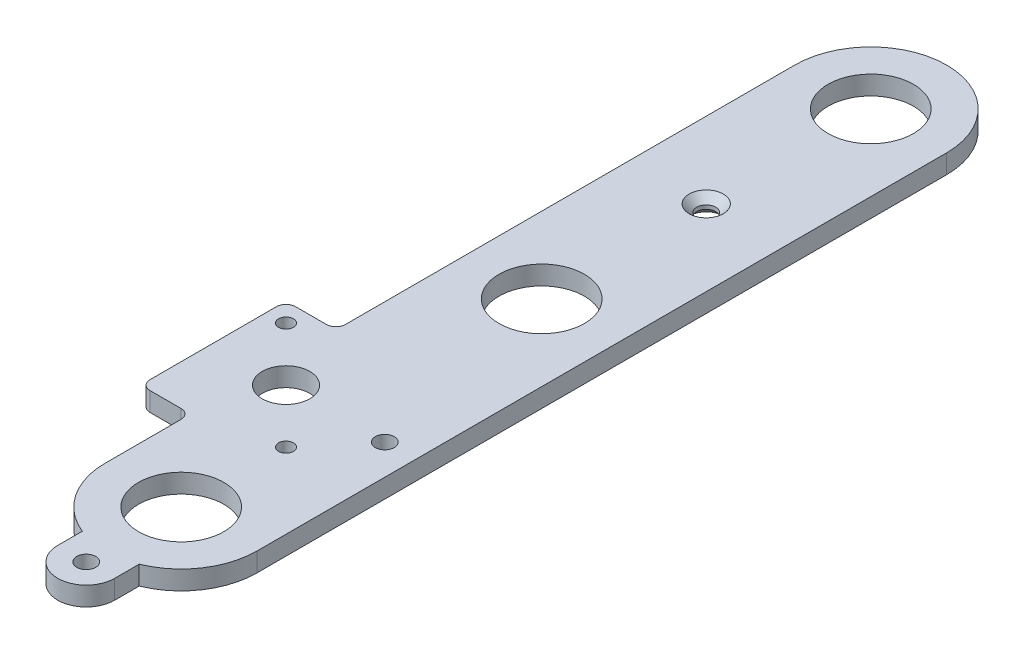
ISO-10303-21;
HEADER;
FILE_DESCRIPTION(('STEP AP214'),'2;1');
FILE_NAME('part.step','',(''),(''),'','','');
FILE_SCHEMA(('AUTOMOTIVE_DESIGN { 1 0 10303 214 1 1 1 1 }'));
ENDSEC;
DATA;
#1=APPLICATION_CONTEXT('core data for automotive mechanical design processes');
#2=APPLICATION_PROTOCOL_DEFINITION('international standard','automotive_design',2000,#1);
#3=PRODUCT_CONTEXT('',#1,'mechanical');
#4=PRODUCT('Part','Part','',(#3));
#5=PRODUCT_RELATED_PRODUCT_CATEGORY('part','',(#4));
#6=PRODUCT_DEFINITION_FORMATION('','',#4);
#7=PRODUCT_DEFINITION_CONTEXT('part definition',#1,'design');
#8=PRODUCT_DEFINITION('design','',#6,#7);
#9=PRODUCT_DEFINITION_SHAPE('','',#8);
#10=(LENGTH_UNIT() NAMED_UNIT(*) SI_UNIT(.MILLI.,.METRE.));
#11=(NAMED_UNIT(*) PLANE_ANGLE_UNIT() SI_UNIT($,.RADIAN.));
#12=(NAMED_UNIT(*) SI_UNIT($,.STERADIAN.) SOLID_ANGLE_UNIT());
#13=UNCERTAINTY_MEASURE_WITH_UNIT(LENGTH_MEASURE(1.E-05),#10,'distance_accuracy_value','');
#14=(GEOMETRIC_REPRESENTATION_CONTEXT(3) GLOBAL_UNCERTAINTY_ASSIGNED_CONTEXT((#13)) GLOBAL_UNIT_ASSIGNED_CONTEXT((#10,
#11,#12)) REPRESENTATION_CONTEXT('',''));
#15=CARTESIAN_POINT('',(0.,0.,0.));
#16=DIRECTION('',(0.,0.,1.));
#17=DIRECTION('',(1.,0.,0.));
#18=AXIS2_PLACEMENT_3D('',#15,#16,#17);
#19=CARTESIAN_POINT('',(-201.295000000001,6.35,-6.81052118455054E-13));
#20=DIRECTION('',(1.,0.,0.));
#21=DIRECTION('',(0.,0.,-1.));
#22=AXIS2_PLACEMENT_3D('',#19,#20,#21);
#23=PLANE('',#22);
#24=DIRECTION('',(0.,0.,1.));
#25=VECTOR('',#24,1.);
#26=CARTESIAN_POINT('',(-201.295000000001,0.,-6.81052118455054E-13));
#27=LINE('',#26,#25);
#28=CARTESIAN_POINT('',(-201.295,0.,-293.953569803471));
#29=VERTEX_POINT('',#28);
#30=CARTESIAN_POINT('',(-201.295,0.,-285.75));
#31=VERTEX_POINT('',#30);
#32=EDGE_CURVE('E258',#29,#31,#27,.T.);
#33=ORIENTED_EDGE('',*,*,#32,.F.);
#34=DIRECTION('',(0.,-1.,0.));
#35=VECTOR('',#34,1.);
#36=CARTESIAN_POINT('',(-201.295,6.35,-293.953569803471));
#37=LINE('',#36,#35);
#38=CARTESIAN_POINT('',(-201.295,6.35,-293.953569803471));
#39=VERTEX_POINT('',#38);
#40=EDGE_CURVE('E114',#39,#29,#37,.T.);
#41=ORIENTED_EDGE('',*,*,#40,.F.);
#42=DIRECTION('',(0.,0.,1.));
#43=VECTOR('',#42,1.);
#44=CARTESIAN_POINT('',(-201.295000000001,6.35,-6.81052118455054E-13));
#45=LINE('',#44,#43);
#46=CARTESIAN_POINT('',(-201.295,6.35,-285.75));
#47=VERTEX_POINT('',#46);
#48=EDGE_CURVE('E342',#39,#47,#45,.T.);
#49=ORIENTED_EDGE('',*,*,#48,.T.);
#50=DIRECTION('',(0.,-1.,0.));
#51=VECTOR('',#50,1.);
#52=CARTESIAN_POINT('',(-201.295,6.35,-285.75));
#53=LINE('',#52,#51);
#54=EDGE_CURVE('E110',#47,#31,#53,.T.);
#55=ORIENTED_EDGE('',*,*,#54,.T.);
#56=EDGE_LOOP('',(#33,#41,#49,#55));
#57=FACE_BOUND('',#56,.T.);
#58=ADVANCED_FACE('F34',(#57),#23,.T.);
#59=CARTESIAN_POINT('',(-210.82,6.35,-317.5));
#60=DIRECTION('',(0.,-1.,0.));
#61=DIRECTION('',(0.,0.,-1.));
#62=AXIS2_PLACEMENT_3D('',#59,#60,#61);
#63=CYLINDRICAL_SURFACE('',#62,25.4);
#64=CARTESIAN_POINT('',(-210.82,0.,-317.5));
#65=DIRECTION('',(0.,1.,0.));
#66=DIRECTION('',(0.,0.,1.));
#67=AXIS2_PLACEMENT_3D('',#64,#65,#66);
#68=CIRCLE('',#67,25.4);
#69=CARTESIAN_POINT('',(-185.42,0.,-317.5));
#70=VERTEX_POINT('',#69);
#71=EDGE_CURVE('E261',#29,#70,#68,.T.);
#72=ORIENTED_EDGE('',*,*,#71,.T.);
#73=DIRECTION('',(0.,-1.,0.));
#74=VECTOR('',#73,1.);
#75=CARTESIAN_POINT('',(-185.42,6.35,-317.5));
#76=LINE('',#75,#74);
#77=CARTESIAN_POINT('',(-185.42,6.35,-317.5));
#78=VERTEX_POINT('',#77);
#79=EDGE_CURVE('E203',#78,#70,#76,.T.);
#80=ORIENTED_EDGE('',*,*,#79,.F.);
#81=CARTESIAN_POINT('',(-210.82,6.35,-317.5));
#82=DIRECTION('',(0.,1.,0.));
#83=DIRECTION('',(0.,0.,1.));
#84=AXIS2_PLACEMENT_3D('',#81,#82,#83);
#85=CIRCLE('',#84,25.4);
#86=EDGE_CURVE('E340',#39,#78,#85,.T.);
#87=ORIENTED_EDGE('',*,*,#86,.F.);
#88=ORIENTED_EDGE('',*,*,#40,.T.);
#89=EDGE_LOOP('',(#72,#80,#87,#88));
#90=FACE_BOUND('',#89,.T.);
#91=ADVANCED_FACE('F405',(#90),#63,.T.);
#92=CARTESIAN_POINT('',(-185.42,6.35,0.));
#93=DIRECTION('',(1.,0.,0.));
#94=DIRECTION('',(0.,0.,-1.));
#95=AXIS2_PLACEMENT_3D('',#92,#93,#94);
#96=PLANE('',#95);
#97=DIRECTION('',(0.,0.,1.));
#98=VECTOR('',#97,1.);
#99=CARTESIAN_POINT('',(-185.42,0.,0.));
#100=LINE('',#99,#98);
#101=CARTESIAN_POINT('',(-185.42,0.,-548.034576396425));
#102=VERTEX_POINT('',#101);
#103=EDGE_CURVE('E263',#102,#70,#100,.T.);
#104=ORIENTED_EDGE('',*,*,#103,.F.);
#105=DIRECTION('',(0.,-1.,0.));
#106=VECTOR('',#105,1.);
#107=CARTESIAN_POINT('',(-185.42,6.35,-548.034576396425));
#108=LINE('',#107,#106);
#109=CARTESIAN_POINT('',(-185.42,6.35,-548.034576396425));
#110=VERTEX_POINT('',#109);
#111=EDGE_CURVE('E201',#110,#102,#108,.T.);
#112=ORIENTED_EDGE('',*,*,#111,.F.);
#113=DIRECTION('',(0.,0.,1.));
#114=VECTOR('',#113,1.);
#115=CARTESIAN_POINT('',(-185.42,6.35,0.));
#116=LINE('',#115,#114);
#117=EDGE_CURVE('E337',#110,#78,#116,.T.);
#118=ORIENTED_EDGE('',*,*,#117,.T.);
#119=ORIENTED_EDGE('',*,*,#79,.T.);
#120=EDGE_LOOP('',(#104,#112,#118,#119));
#121=FACE_BOUND('',#120,.T.);
#122=ADVANCED_FACE('F409',(#121),#96,.T.);
#123=CARTESIAN_POINT('',(-210.82,6.35,-548.034576396425));
#124=DIRECTION('',(0.,-1.,0.));
#125=DIRECTION('',(0.,0.,-1.));
#126=AXIS2_PLACEMENT_3D('',#123,#124,#125);
#127=CYLINDRICAL_SURFACE('',#126,25.4);
#128=CARTESIAN_POINT('',(-210.82,0.,-548.034576396425));
#129=DIRECTION('',(0.,1.,0.));
#130=DIRECTION('',(0.,0.,1.));
#131=AXIS2_PLACEMENT_3D('',#128,#129,#130);
#132=CIRCLE('',#131,25.4);
#133=CARTESIAN_POINT('',(-236.22,0.,-548.034576396425));
#134=VERTEX_POINT('',#133);
#135=EDGE_CURVE('E269',#102,#134,#132,.T.);
#136=ORIENTED_EDGE('',*,*,#135,.T.);
#137=DIRECTION('',(0.,-1.,0.));
#138=VECTOR('',#137,1.);
#139=CARTESIAN_POINT('',(-236.22,6.35,-548.034576396425));
#140=LINE('',#139,#138);
#141=CARTESIAN_POINT('',(-236.22,6.35,-548.034576396425));
#142=VERTEX_POINT('',#141);
#143=EDGE_CURVE('E199',#142,#134,#140,.T.);
#144=ORIENTED_EDGE('',*,*,#143,.F.);
#145=CARTESIAN_POINT('',(-210.82,6.35,-548.034576396425));
#146=DIRECTION('',(0.,1.,0.));
#147=DIRECTION('',(0.,0.,1.));
#148=AXIS2_PLACEMENT_3D('',#145,#146,#147);
#149=CIRCLE('',#148,25.4);
#150=EDGE_CURVE('E335',#110,#142,#149,.T.);
#151=ORIENTED_EDGE('',*,*,#150,.F.);
#152=ORIENTED_EDGE('',*,*,#111,.T.);
#153=EDGE_LOOP('',(#136,#144,#151,#152));
#154=FACE_BOUND('',#153,.T.);
#155=ADVANCED_FACE('F415',(#154),#127,.T.);
#156=CARTESIAN_POINT('',(-236.22,6.35,0.));
#157=DIRECTION('',(-1.,0.,0.));
#158=DIRECTION('',(0.,0.,1.));
#159=AXIS2_PLACEMENT_3D('',#156,#157,#158);
#160=PLANE('',#159);
#161=DIRECTION('',(0.,0.,-1.));
#162=VECTOR('',#161,1.);
#163=CARTESIAN_POINT('',(-236.22,0.,0.));
#164=LINE('',#163,#162);
#165=CARTESIAN_POINT('',(-236.22,0.,-397.808393353847));
#166=VERTEX_POINT('',#165);
#167=EDGE_CURVE('E272',#166,#134,#164,.T.);
#168=ORIENTED_EDGE('',*,*,#167,.F.);
#169=DIRECTION('',(0.,-1.,0.));
#170=VECTOR('',#169,1.);
#171=CARTESIAN_POINT('',(-236.22,6.35,-397.808393353847));
#172=LINE('',#171,#170);
#173=CARTESIAN_POINT('',(-236.22,6.35,-397.808393353847));
#174=VERTEX_POINT('',#173);
#175=EDGE_CURVE('E197',#174,#166,#172,.T.);
#176=ORIENTED_EDGE('',*,*,#175,.F.);
#177=DIRECTION('',(0.,0.,-1.));
#178=VECTOR('',#177,1.);
#179=CARTESIAN_POINT('',(-236.22,6.35,0.));
#180=LINE('',#179,#178);
#181=EDGE_CURVE('E332',#174,#142,#180,.T.);
#182=ORIENTED_EDGE('',*,*,#181,.T.);
#183=ORIENTED_EDGE('',*,*,#143,.T.);
#184=EDGE_LOOP('',(#168,#176,#182,#183));
#185=FACE_BOUND('',#184,.T.);
#186=ADVANCED_FACE('F419',(#185),#160,.T.);
#187=CARTESIAN_POINT('',(-239.395,6.35,-397.808393353847));
#188=DIRECTION('',(0.,-1.,0.));
#189=DIRECTION('',(0.,0.,-1.));
#190=AXIS2_PLACEMENT_3D('',#187,#188,#189);
#191=CYLINDRICAL_SURFACE('',#190,3.17500000000003);
#192=CARTESIAN_POINT('',(-239.395,0.,-397.808393353847));
#193=DIRECTION('',(0.,1.,0.));
#194=DIRECTION('',(0.,0.,1.));
#195=AXIS2_PLACEMENT_3D('',#192,#193,#194);
#196=CIRCLE('',#195,3.17500000000003);
#197=CARTESIAN_POINT('',(-239.395,0.,-394.633393353847));
#198=VERTEX_POINT('',#197);
#199=EDGE_CURVE('E275',#198,#166,#196,.T.);
#200=ORIENTED_EDGE('',*,*,#199,.F.);
#201=DIRECTION('',(0.,-1.,0.));
#202=VECTOR('',#201,1.);
#203=CARTESIAN_POINT('',(-239.395,6.35,-394.633393353847));
#204=LINE('',#203,#202);
#205=CARTESIAN_POINT('',(-239.395,6.35,-394.633393353847));
#206=VERTEX_POINT('',#205);
#207=EDGE_CURVE('E195',#206,#198,#204,.T.);
#208=ORIENTED_EDGE('',*,*,#207,.F.);
#209=CARTESIAN_POINT('',(-239.395,6.35,-397.808393353847));
#210=DIRECTION('',(0.,1.,0.));
#211=DIRECTION('',(0.,0.,1.));
#212=AXIS2_PLACEMENT_3D('',#209,#210,#211);
#213=CIRCLE('',#212,3.17500000000003);
#214=EDGE_CURVE('E329',#206,#174,#213,.T.);
#215=ORIENTED_EDGE('',*,*,#214,.T.);
#216=ORIENTED_EDGE('',*,*,#175,.T.);
#217=EDGE_LOOP('',(#200,#208,#215,#216));
#218=FACE_BOUND('',#217,.T.);
#219=ADVANCED_FACE('F423',(#218),#191,.F.);
#220=CARTESIAN_POINT('',(0.,6.35,-394.633393353847));
#221=DIRECTION('',(0.,0.,-1.));
#222=DIRECTION('',(-1.,0.,0.));
#223=AXIS2_PLACEMENT_3D('',#220,#221,#222);
#224=PLANE('',#223);
#225=DIRECTION('',(1.,0.,0.));
#226=VECTOR('',#225,1.);
#227=CARTESIAN_POINT('',(0.,0.,-394.633393353847));
#228=LINE('',#227,#226);
#229=CARTESIAN_POINT('',(-249.735512242138,0.,-394.633393353847));
#230=VERTEX_POINT('',#229);
#231=EDGE_CURVE('E278',#230,#198,#228,.T.);
#232=ORIENTED_EDGE('',*,*,#231,.F.);
#233=DIRECTION('',(0.,-1.,0.));
#234=VECTOR('',#233,1.);
#235=CARTESIAN_POINT('',(-249.735512242138,6.35,-394.633393353847));
#236=LINE('',#235,#234);
#237=CARTESIAN_POINT('',(-249.735512242138,6.35,-394.633393353847));
#238=VERTEX_POINT('',#237);
#239=EDGE_CURVE('E193',#238,#230,#236,.T.);
#240=ORIENTED_EDGE('',*,*,#239,.F.);
#241=DIRECTION('',(1.,0.,0.));
#242=VECTOR('',#241,1.);
#243=CARTESIAN_POINT('',(0.,6.35,-394.633393353847));
#244=LINE('',#243,#242);
#245=EDGE_CURVE('E326',#238,#206,#244,.T.);
#246=ORIENTED_EDGE('',*,*,#245,.T.);
#247=ORIENTED_EDGE('',*,*,#207,.T.);
#248=EDGE_LOOP('',(#232,#240,#246,#247));
#249=FACE_BOUND('',#248,.T.);
#250=ADVANCED_FACE('F427',(#249),#224,.T.);
#251=CARTESIAN_POINT('',(-249.735512242138,6.35,-391.458393353847));
#252=DIRECTION('',(0.,-1.,0.));
#253=DIRECTION('',(0.,0.,-1.));
#254=AXIS2_PLACEMENT_3D('',#251,#252,#253);
#255=CYLINDRICAL_SURFACE('',#254,3.17499999999997);
#256=CARTESIAN_POINT('',(-249.735512242138,0.,-391.458393353847));
#257=DIRECTION('',(0.,1.,0.));
#258=DIRECTION('',(0.,0.,1.));
#259=AXIS2_PLACEMENT_3D('',#256,#257,#258);
#260=CIRCLE('',#259,3.17499999999997);
#261=CARTESIAN_POINT('',(-252.910512242138,0.,-391.458393353847));
#262=VERTEX_POINT('',#261);
#263=EDGE_CURVE('E281',#262,#230,#260,.F.);
#264=ORIENTED_EDGE('',*,*,#263,.F.);
#265=DIRECTION('',(0.,-1.,0.));
#266=VECTOR('',#265,1.);
#267=CARTESIAN_POINT('',(-252.910512242138,6.35,-391.458393353847));
#268=LINE('',#267,#266);
#269=CARTESIAN_POINT('',(-252.910512242138,6.35,-391.458393353847));
#270=VERTEX_POINT('',#269);
#271=EDGE_CURVE('E191',#270,#262,#268,.T.);
#272=ORIENTED_EDGE('',*,*,#271,.F.);
#273=CARTESIAN_POINT('',(-249.735512242138,6.35,-391.458393353847));
#274=DIRECTION('',(0.,1.,0.));
#275=DIRECTION('',(0.,0.,1.));
#276=AXIS2_PLACEMENT_3D('',#273,#274,#275);
#277=CIRCLE('',#276,3.17499999999997);
#278=EDGE_CURVE('E323',#270,#238,#277,.F.);
#279=ORIENTED_EDGE('',*,*,#278,.T.);
#280=ORIENTED_EDGE('',*,*,#239,.T.);
#281=EDGE_LOOP('',(#264,#272,#279,#280));
#282=FACE_BOUND('',#281,.T.);
#283=ADVANCED_FACE('F431',(#282),#255,.T.);
#284=CARTESIAN_POINT('',(-252.910512242138,6.35,0.));
#285=DIRECTION('',(-1.,0.,0.));
#286=DIRECTION('',(0.,0.,1.));
#287=AXIS2_PLACEMENT_3D('',#284,#285,#286);
#288=PLANE('',#287);
#289=DIRECTION('',(0.,0.,-1.));
#290=VECTOR('',#289,1.);
#291=CARTESIAN_POINT('',(-252.910512242138,0.,0.));
#292=LINE('',#291,#290);
#293=CARTESIAN_POINT('',(-252.910512242138,0.,-349.18736886957));
#294=VERTEX_POINT('',#293);
#295=EDGE_CURVE('E284',#294,#262,#292,.T.);
#296=ORIENTED_EDGE('',*,*,#295,.F.);
#297=DIRECTION('',(0.,-1.,0.));
#298=VECTOR('',#297,1.);
#299=CARTESIAN_POINT('',(-252.910512242138,6.35,-349.18736886957));
#300=LINE('',#299,#298);
#301=CARTESIAN_POINT('',(-252.910512242138,6.35,-349.18736886957));
#302=VERTEX_POINT('',#301);
#303=EDGE_CURVE('E189',#302,#294,#300,.T.);
#304=ORIENTED_EDGE('',*,*,#303,.F.);
#305=DIRECTION('',(0.,0.,-1.));
#306=VECTOR('',#305,1.);
#307=CARTESIAN_POINT('',(-252.910512242138,6.35,0.));
#308=LINE('',#307,#306);
#309=EDGE_CURVE('E320',#302,#270,#308,.T.);
#310=ORIENTED_EDGE('',*,*,#309,.T.);
#311=ORIENTED_EDGE('',*,*,#271,.T.);
#312=EDGE_LOOP('',(#296,#304,#310,#311));
#313=FACE_BOUND('',#312,.T.);
#314=ADVANCED_FACE('F435',(#313),#288,.T.);
#315=CARTESIAN_POINT('',(-249.735512242138,6.35,-349.18736886957));
#316=DIRECTION('',(0.,-1.,0.));
#317=DIRECTION('',(0.,0.,-1.));
#318=AXIS2_PLACEMENT_3D('',#315,#316,#317);
#319=CYLINDRICAL_SURFACE('',#318,3.175);
#320=CARTESIAN_POINT('',(-249.735512242138,0.,-349.18736886957));
#321=DIRECTION('',(0.,1.,0.));
#322=DIRECTION('',(0.,0.,1.));
#323=AXIS2_PLACEMENT_3D('',#320,#321,#322);
#324=CIRCLE('',#323,3.175);
#325=CARTESIAN_POINT('',(-249.735512242138,0.,-346.01236886957));
#326=VERTEX_POINT('',#325);
#327=EDGE_CURVE('E287',#326,#294,#324,.F.);
#328=ORIENTED_EDGE('',*,*,#327,.F.);
#329=DIRECTION('',(0.,-1.,0.));
#330=VECTOR('',#329,1.);
#331=CARTESIAN_POINT('',(-249.735512242138,6.35,-346.01236886957));
#332=LINE('',#331,#330);
#333=CARTESIAN_POINT('',(-249.735512242138,6.35,-346.01236886957));
#334=VERTEX_POINT('',#333);
#335=EDGE_CURVE('E187',#334,#326,#332,.T.);
#336=ORIENTED_EDGE('',*,*,#335,.F.);
#337=CARTESIAN_POINT('',(-249.735512242138,6.35,-349.18736886957));
#338=DIRECTION('',(0.,1.,0.));
#339=DIRECTION('',(0.,0.,1.));
#340=AXIS2_PLACEMENT_3D('',#337,#338,#339);
#341=CIRCLE('',#340,3.175);
#342=EDGE_CURVE('E317',#334,#302,#341,.F.);
#343=ORIENTED_EDGE('',*,*,#342,.T.);
#344=ORIENTED_EDGE('',*,*,#303,.T.);
#345=EDGE_LOOP('',(#328,#336,#343,#344));
#346=FACE_BOUND('',#345,.T.);
#347=ADVANCED_FACE('F439',(#346),#319,.T.);
#348=CARTESIAN_POINT('',(1.85750420157449E-12,6.35,-346.012368869569));
#349=DIRECTION('',(0.,0.,-1.));
#350=DIRECTION('',(-1.,0.,0.));
#351=AXIS2_PLACEMENT_3D('',#348,#349,#350);
#352=PLANE('',#351);
#353=DIRECTION('',(1.,0.,0.));
#354=VECTOR('',#353,1.);
#355=CARTESIAN_POINT('',(1.85750420157449E-12,0.,-346.012368869569));
#356=LINE('',#355,#354);
#357=CARTESIAN_POINT('',(-239.395,0.,-346.01236886957));
#358=VERTEX_POINT('',#357);
#359=EDGE_CURVE('E290',#326,#358,#356,.T.);
#360=ORIENTED_EDGE('',*,*,#359,.T.);
#361=DIRECTION('',(0.,-1.,0.));
#362=VECTOR('',#361,1.);
#363=CARTESIAN_POINT('',(-239.395,6.35,-346.01236886957));
#364=LINE('',#363,#362);
#365=CARTESIAN_POINT('',(-239.395,6.35,-346.01236886957));
#366=VERTEX_POINT('',#365);
#367=EDGE_CURVE('E184',#366,#358,#364,.T.);
#368=ORIENTED_EDGE('',*,*,#367,.F.);
#369=DIRECTION('',(1.,0.,0.));
#370=VECTOR('',#369,1.);
#371=CARTESIAN_POINT('',(1.85750420157449E-12,6.35,-346.012368869569));
#372=LINE('',#371,#370);
#373=EDGE_CURVE('E314',#334,#366,#372,.T.);
#374=ORIENTED_EDGE('',*,*,#373,.F.);
#375=ORIENTED_EDGE('',*,*,#335,.T.);
#376=EDGE_LOOP('',(#360,#368,#374,#375));
#377=FACE_BOUND('',#376,.T.);
#378=ADVANCED_FACE('F443',(#377),#352,.F.);
#379=CARTESIAN_POINT('',(-239.395,6.35,-342.83736886957));
#380=DIRECTION('',(0.,-1.,0.));
#381=DIRECTION('',(0.,0.,-1.));
#382=AXIS2_PLACEMENT_3D('',#379,#380,#381);
#383=CYLINDRICAL_SURFACE('',#382,3.17499999999997);
#384=CARTESIAN_POINT('',(-239.395,0.,-342.83736886957));
#385=DIRECTION('',(0.,1.,0.));
#386=DIRECTION('',(0.,0.,1.));
#387=AXIS2_PLACEMENT_3D('',#384,#385,#386);
#388=CIRCLE('',#387,3.17499999999997);
#389=CARTESIAN_POINT('',(-236.22,0.,-342.83736886957));
#390=VERTEX_POINT('',#389);
#391=EDGE_CURVE('E293',#358,#390,#388,.F.);
#392=ORIENTED_EDGE('',*,*,#391,.T.);
#393=DIRECTION('',(0.,-1.,0.));
#394=VECTOR('',#393,1.);
#395=CARTESIAN_POINT('',(-236.22,6.35,-342.83736886957));
#396=LINE('',#395,#394);
#397=CARTESIAN_POINT('',(-236.22,6.35,-342.83736886957));
#398=VERTEX_POINT('',#397);
#399=EDGE_CURVE('E177',#398,#390,#396,.T.);
#400=ORIENTED_EDGE('',*,*,#399,.F.);
#401=CARTESIAN_POINT('',(-239.395,6.35,-342.83736886957));
#402=DIRECTION('',(0.,1.,0.));
#403=DIRECTION('',(0.,0.,1.));
#404=AXIS2_PLACEMENT_3D('',#401,#402,#403);
#405=CIRCLE('',#404,3.17499999999997);
#406=EDGE_CURVE('E312',#366,#398,#405,.F.);
#407=ORIENTED_EDGE('',*,*,#406,.F.);
#408=ORIENTED_EDGE('',*,*,#367,.T.);
#409=EDGE_LOOP('',(#392,#400,#407,#408));
#410=FACE_BOUND('',#409,.T.);
#411=ADVANCED_FACE('F447',(#410),#383,.F.);
#412=CARTESIAN_POINT('',(-236.22,6.35,2.58764913818576E-13));
#413=DIRECTION('',(1.,0.,0.));
#414=DIRECTION('',(0.,0.,-1.));
#415=AXIS2_PLACEMENT_3D('',#412,#413,#414);
#416=PLANE('',#415);
#417=DIRECTION('',(0.,0.,1.));
#418=VECTOR('',#417,1.);
#419=CARTESIAN_POINT('',(-236.22,0.,2.58764913818576E-13));
#420=LINE('',#419,#418);
#421=CARTESIAN_POINT('',(-236.22,0.,-317.5));
#422=VERTEX_POINT('',#421);
#423=EDGE_CURVE('E296',#390,#422,#420,.T.);
#424=ORIENTED_EDGE('',*,*,#423,.T.);
#425=DIRECTION('',(0.,-1.,0.));
#426=VECTOR('',#425,1.);
#427=CARTESIAN_POINT('',(-236.22,6.35,-317.5));
#428=LINE('',#427,#426);
#429=CARTESIAN_POINT('',(-236.22,6.35,-317.5));
#430=VERTEX_POINT('',#429);
#431=EDGE_CURVE('E175',#430,#422,#428,.T.);
#432=ORIENTED_EDGE('',*,*,#431,.F.);
#433=DIRECTION('',(0.,0.,1.));
#434=VECTOR('',#433,1.);
#435=CARTESIAN_POINT('',(-236.22,6.35,2.58764913818576E-13));
#436=LINE('',#435,#434);
#437=EDGE_CURVE('E168',#398,#430,#436,.T.);
#438=ORIENTED_EDGE('',*,*,#437,.F.);
#439=ORIENTED_EDGE('',*,*,#399,.T.);
#440=EDGE_LOOP('',(#424,#432,#438,#439));
#441=FACE_BOUND('',#440,.T.);
#442=ADVANCED_FACE('F451',(#441),#416,.F.);
#443=CARTESIAN_POINT('',(-210.82,6.35,-317.5));
#444=DIRECTION('',(0.,-1.,0.));
#445=DIRECTION('',(0.,0.,-1.));
#446=AXIS2_PLACEMENT_3D('',#443,#444,#445);
#447=CYLINDRICAL_SURFACE('',#446,25.3999999999999);
#448=CARTESIAN_POINT('',(-210.82,0.,-317.5));
#449=DIRECTION('',(0.,1.,0.));
#450=DIRECTION('',(0.,0.,1.));
#451=AXIS2_PLACEMENT_3D('',#448,#449,#450);
#452=CIRCLE('',#451,25.3999999999999);
#453=CARTESIAN_POINT('',(-220.345,0.,-293.953569803471));
#454=VERTEX_POINT('',#453);
#455=EDGE_CURVE('E174',#422,#454,#452,.T.);
#456=ORIENTED_EDGE('',*,*,#455,.T.);
#457=DIRECTION('',(0.,-1.,0.));
#458=VECTOR('',#457,1.);
#459=CARTESIAN_POINT('',(-220.345,6.35,-293.953569803471));
#460=LINE('',#459,#458);
#461=CARTESIAN_POINT('',(-220.345,6.35,-293.953569803471));
#462=VERTEX_POINT('',#461);
#463=EDGE_CURVE('E160',#462,#454,#460,.T.);
#464=ORIENTED_EDGE('',*,*,#463,.F.);
#465=CARTESIAN_POINT('',(-210.82,6.35,-317.5));
#466=DIRECTION('',(0.,1.,0.));
#467=DIRECTION('',(0.,0.,1.));
#468=AXIS2_PLACEMENT_3D('',#465,#466,#467);
#469=CIRCLE('',#468,25.3999999999999);
#470=EDGE_CURVE('E163',#430,#462,#469,.T.);
#471=ORIENTED_EDGE('',*,*,#470,.F.);
#472=ORIENTED_EDGE('',*,*,#431,.T.);
#473=EDGE_LOOP('',(#456,#464,#471,#472));
#474=FACE_BOUND('',#473,.T.);
#475=ADVANCED_FACE('F173',(#474),#447,.T.);
#476=CARTESIAN_POINT('',(-220.345000000001,6.35,-7.45505000327772E-13));
#477=DIRECTION('',(1.,0.,0.));
#478=DIRECTION('',(0.,0.,-1.));
#479=AXIS2_PLACEMENT_3D('',#476,#477,#478);
#480=PLANE('',#479);
#481=DIRECTION('',(0.,0.,1.));
#482=VECTOR('',#481,1.);
#483=CARTESIAN_POINT('',(-220.345000000001,0.,-7.45505000327772E-13));
#484=LINE('',#483,#482);
#485=CARTESIAN_POINT('',(-220.345,0.,-285.75));
#486=VERTEX_POINT('',#485);
#487=EDGE_CURVE('E300',#454,#486,#484,.T.);
#488=ORIENTED_EDGE('',*,*,#487,.T.);
#489=DIRECTION('',(0.,-1.,0.));
#490=VECTOR('',#489,1.);
#491=CARTESIAN_POINT('',(-220.345,6.35,-285.75));
#492=LINE('',#491,#490);
#493=CARTESIAN_POINT('',(-220.345,6.35,-285.75));
#494=VERTEX_POINT('',#493);
#495=EDGE_CURVE('E162',#494,#486,#492,.T.);
#496=ORIENTED_EDGE('',*,*,#495,.F.);
#497=DIRECTION('',(0.,0.,1.));
#498=VECTOR('',#497,1.);
#499=CARTESIAN_POINT('',(-220.345000000001,6.35,-7.45505000327772E-13));
#500=LINE('',#499,#498);
#501=EDGE_CURVE('E155',#462,#494,#500,.T.);
#502=ORIENTED_EDGE('',*,*,#501,.F.);
#503=ORIENTED_EDGE('',*,*,#463,.T.);
#504=EDGE_LOOP('',(#488,#496,#502,#503));
#505=FACE_BOUND('',#504,.T.);
#506=ADVANCED_FACE('F158',(#505),#480,.F.);
#507=CARTESIAN_POINT('',(-210.82,6.35,-285.75));
#508=DIRECTION('',(0.,-1.,0.));
#509=DIRECTION('',(0.,0.,-1.));
#510=AXIS2_PLACEMENT_3D('',#507,#508,#509);
#511=CYLINDRICAL_SURFACE('',#510,3.175);
#512=CARTESIAN_POINT('',(-210.82,6.35,-285.75));
#513=DIRECTION('',(0.,1.,0.));
#514=DIRECTION('',(0.,0.,1.));
#515=AXIS2_PLACEMENT_3D('',#512,#513,#514);
#516=CIRCLE('',#515,3.175);
#517=CARTESIAN_POINT('',(-210.82,6.35,-282.575));
#518=VERTEX_POINT('',#517);
#519=EDGE_CURVE('E344',#518,#518,#516,.T.);
#520=ORIENTED_EDGE('',*,*,#519,.T.);
#521=EDGE_LOOP('',(#520));
#522=FACE_BOUND('',#521,.T.);
#523=CARTESIAN_POINT('',(-210.82,0.,-285.75));
#524=DIRECTION('',(0.,1.,0.));
#525=DIRECTION('',(0.,0.,1.));
#526=AXIS2_PLACEMENT_3D('',#523,#524,#525);
#527=CIRCLE('',#526,3.175);
#528=CARTESIAN_POINT('',(-210.82,0.,-282.575));
#529=VERTEX_POINT('',#528);
#530=EDGE_CURVE('E256',#529,#529,#527,.T.);
#531=ORIENTED_EDGE('',*,*,#530,.F.);
#532=EDGE_LOOP('',(#531));
#533=FACE_BOUND('',#532,.T.);
#534=ADVANCED_FACE('F390',(#522,#533),#511,.F.);
#535=CARTESIAN_POINT('',(-210.639487757862,6.35,-352.36236886957));
#536=DIRECTION('',(0.,-1.,0.));
#537=DIRECTION('',(0.,0.,-1.));
#538=AXIS2_PLACEMENT_3D('',#535,#536,#537);
#539=CYLINDRICAL_SURFACE('',#538,2.48920000000001);
#540=CARTESIAN_POINT('',(-210.639487757862,6.35,-352.36236886957));
#541=DIRECTION('',(0.,1.,0.));
#542=DIRECTION('',(0.,0.,1.));
#543=AXIS2_PLACEMENT_3D('',#540,#541,#542);
#544=CIRCLE('',#543,2.48920000000001);
#545=CARTESIAN_POINT('',(-210.639487757862,6.35,-349.87316886957));
#546=VERTEX_POINT('',#545);
#547=EDGE_CURVE('E347',#546,#546,#544,.T.);
#548=ORIENTED_EDGE('',*,*,#547,.T.);
#549=EDGE_LOOP('',(#548));
#550=FACE_BOUND('',#549,.T.);
#551=CARTESIAN_POINT('',(-210.639487757862,0.,-352.36236886957));
#552=DIRECTION('',(0.,1.,0.));
#553=DIRECTION('',(0.,0.,1.));
#554=AXIS2_PLACEMENT_3D('',#551,#552,#553);
#555=CIRCLE('',#554,2.48920000000001);
#556=CARTESIAN_POINT('',(-210.639487757862,0.,-349.87316886957));
#557=VERTEX_POINT('',#556);
#558=EDGE_CURVE('E253',#557,#557,#555,.T.);
#559=ORIENTED_EDGE('',*,*,#558,.F.);
#560=EDGE_LOOP('',(#559));
#561=FACE_BOUND('',#560,.T.);
#562=ADVANCED_FACE('F393',(#550,#561),#539,.F.);
#563=CARTESIAN_POINT('',(-246.560512242138,6.35,-388.283393353847));
#564=DIRECTION('',(0.,-1.,0.));
#565=DIRECTION('',(0.,0.,-1.));
#566=AXIS2_PLACEMENT_3D('',#563,#564,#565);
#567=CYLINDRICAL_SURFACE('',#566,2.48920000000001);
#568=CARTESIAN_POINT('',(-246.560512242138,6.35,-388.283393353847));
#569=DIRECTION('',(0.,1.,0.));
#570=DIRECTION('',(0.,0.,1.));
#571=AXIS2_PLACEMENT_3D('',#568,#569,#570);
#572=CIRCLE('',#571,2.48920000000001);
#573=CARTESIAN_POINT('',(-246.560512242138,6.35,-385.794193353847));
#574=VERTEX_POINT('',#573);
#575=EDGE_CURVE('E350',#574,#574,#572,.T.);
#576=ORIENTED_EDGE('',*,*,#575,.T.);
#577=EDGE_LOOP('',(#576));
#578=FACE_BOUND('',#577,.T.);
#579=CARTESIAN_POINT('',(-246.560512242138,0.,-388.283393353847));
#580=DIRECTION('',(0.,1.,0.));
#581=DIRECTION('',(0.,0.,1.));
#582=AXIS2_PLACEMENT_3D('',#579,#580,#581);
#583=CIRCLE('',#582,2.48920000000001);
#584=CARTESIAN_POINT('',(-246.560512242138,0.,-385.794193353847));
#585=VERTEX_POINT('',#584);
#586=EDGE_CURVE('E249',#585,#585,#583,.T.);
#587=ORIENTED_EDGE('',*,*,#586,.F.);
#588=EDGE_LOOP('',(#587));
#589=FACE_BOUND('',#588,.T.);
#590=ADVANCED_FACE('F399',(#578,#589),#567,.F.);
#591=CARTESIAN_POINT('',(-210.82,6.35,-317.5));
#592=DIRECTION('',(0.,-1.,0.));
#593=DIRECTION('',(0.,0.,-1.));
#594=AXIS2_PLACEMENT_3D('',#591,#592,#593);
#595=CYLINDRICAL_SURFACE('',#594,14.2748);
#596=CARTESIAN_POINT('',(-210.82,6.35,-317.5));
#597=DIRECTION('',(0.,1.,0.));
#598=DIRECTION('',(0.,0.,1.));
#599=AXIS2_PLACEMENT_3D('',#596,#597,#598);
#600=CIRCLE('',#599,14.2748);
#601=CARTESIAN_POINT('',(-210.82,6.35,-303.2252));
#602=VERTEX_POINT('',#601);
#603=EDGE_CURVE('E353',#602,#602,#600,.T.);
#604=ORIENTED_EDGE('',*,*,#603,.T.);
#605=EDGE_LOOP('',(#604));
#606=FACE_BOUND('',#605,.T.);
#607=CARTESIAN_POINT('',(-210.82,0.,-317.5));
#608=DIRECTION('',(0.,1.,0.));
#609=DIRECTION('',(0.,0.,1.));
#610=AXIS2_PLACEMENT_3D('',#607,#608,#609);
#611=CIRCLE('',#610,14.2748);
#612=CARTESIAN_POINT('',(-210.82,0.,-303.2252));
#613=VERTEX_POINT('',#612);
#614=EDGE_CURVE('E245',#613,#613,#611,.T.);
#615=ORIENTED_EDGE('',*,*,#614,.F.);
#616=EDGE_LOOP('',(#615));
#617=FACE_BOUND('',#616,.T.);
#618=ADVANCED_FACE('F502',(#606,#617),#595,.F.);
#619=CARTESIAN_POINT('',(-210.82,6.35,-548.034576396425));
#620=DIRECTION('',(0.,-1.,0.));
#621=DIRECTION('',(0.,0.,-1.));
#622=AXIS2_PLACEMENT_3D('',#619,#620,#621);
#623=CYLINDRICAL_SURFACE('',#622,14.2748);
#624=CARTESIAN_POINT('',(-210.82,6.35,-548.034576396425));
#625=DIRECTION('',(0.,1.,0.));
#626=DIRECTION('',(0.,0.,1.));
#627=AXIS2_PLACEMENT_3D('',#624,#625,#626);
#628=CIRCLE('',#627,14.2748);
#629=CARTESIAN_POINT('',(-210.82,6.35,-533.759776396425));
#630=VERTEX_POINT('',#629);
#631=EDGE_CURVE('E356',#630,#630,#628,.T.);
#632=ORIENTED_EDGE('',*,*,#631,.T.);
#633=EDGE_LOOP('',(#632));
#634=FACE_BOUND('',#633,.T.);
#635=CARTESIAN_POINT('',(-210.82,0.,-548.034576396425));
#636=DIRECTION('',(0.,1.,0.));
#637=DIRECTION('',(0.,0.,1.));
#638=AXIS2_PLACEMENT_3D('',#635,#636,#637);
#639=CIRCLE('',#638,14.2748);
#640=CARTESIAN_POINT('',(-210.82,0.,-533.759776396425));
#641=VERTEX_POINT('',#640);
#642=EDGE_CURVE('E241',#641,#641,#639,.T.);
#643=ORIENTED_EDGE('',*,*,#642,.F.);
#644=EDGE_LOOP('',(#643));
#645=FACE_BOUND('',#644,.T.);
#646=ADVANCED_FACE('F498',(#634,#645),#623,.F.);
#647=CARTESIAN_POINT('',(-195.58,6.35,-370.322881111709));
#648=DIRECTION('',(0.,-1.,0.));
#649=DIRECTION('',(0.,0.,-1.));
#650=AXIS2_PLACEMENT_3D('',#647,#648,#649);
#651=CYLINDRICAL_SURFACE('',#650,3.17499999999997);
#652=CARTESIAN_POINT('',(-195.58,6.35,-370.322881111709));
#653=DIRECTION('',(0.,1.,0.));
#654=DIRECTION('',(0.,0.,1.));
#655=AXIS2_PLACEMENT_3D('',#652,#653,#654);
#656=CIRCLE('',#655,3.17499999999997);
#657=CARTESIAN_POINT('',(-195.58,6.35,-367.147881111709));
#658=VERTEX_POINT('',#657);
#659=EDGE_CURVE('E359',#658,#658,#656,.T.);
#660=ORIENTED_EDGE('',*,*,#659,.T.);
#661=EDGE_LOOP('',(#660));
#662=FACE_BOUND('',#661,.T.);
#663=CARTESIAN_POINT('',(-195.58,0.,-370.322881111709));
#664=DIRECTION('',(0.,1.,0.));
#665=DIRECTION('',(0.,0.,1.));
#666=AXIS2_PLACEMENT_3D('',#663,#664,#665);
#667=CIRCLE('',#666,3.17499999999997);
#668=CARTESIAN_POINT('',(-195.58,0.,-367.147881111709));
#669=VERTEX_POINT('',#668);
#670=EDGE_CURVE('E237',#669,#669,#667,.T.);
#671=ORIENTED_EDGE('',*,*,#670,.F.);
#672=EDGE_LOOP('',(#671));
#673=FACE_BOUND('',#672,.T.);
#674=ADVANCED_FACE('F495',(#662,#673),#651,.F.);
#675=CARTESIAN_POINT('',(-210.82,6.35,-493.030876396425));
#676=DIRECTION('',(0.,-1.,0.));
#677=DIRECTION('',(0.,0.,-1.));
#678=AXIS2_PLACEMENT_3D('',#675,#676,#677);
#679=CYLINDRICAL_SURFACE('',#678,3.175);
#680=CARTESIAN_POINT('',(-210.82,2.53999999999998,-493.030876396425));
#681=DIRECTION('',(0.,1.,0.));
#682=DIRECTION('',(0.,0.,1.));
#683=AXIS2_PLACEMENT_3D('',#680,#681,#682);
#684=CIRCLE('',#683,3.175);
#685=CARTESIAN_POINT('',(-210.82,2.53999999999998,-489.855876396425));
#686=VERTEX_POINT('',#685);
#687=EDGE_CURVE('E43',#686,#686,#684,.F.);
#688=ORIENTED_EDGE('',*,*,#687,.T.);
#689=EDGE_LOOP('',(#688));
#690=FACE_BOUND('',#689,.T.);
#691=CARTESIAN_POINT('',(-210.82,3.80999999999996,-493.030876396425));
#692=DIRECTION('',(0.,1.,0.));
#693=DIRECTION('',(0.,0.,1.));
#694=AXIS2_PLACEMENT_3D('',#691,#692,#693);
#695=CIRCLE('',#694,3.175);
#696=CARTESIAN_POINT('',(-210.82,3.80999999999996,-489.855876396425));
#697=VERTEX_POINT('',#696);
#698=EDGE_CURVE('E209',#697,#697,#695,.T.);
#699=ORIENTED_EDGE('',*,*,#698,.T.);
#700=EDGE_LOOP('',(#699));
#701=FACE_BOUND('',#700,.T.);
#702=ADVANCED_FACE('F214',(#690,#701),#679,.F.);
#703=CARTESIAN_POINT('',(-228.6,6.35,-370.322881111709));
#704=DIRECTION('',(0.,-1.,0.));
#705=DIRECTION('',(0.,0.,-1.));
#706=AXIS2_PLACEMENT_3D('',#703,#704,#705);
#707=CYLINDRICAL_SURFACE('',#706,7.93749999999998);
#708=CARTESIAN_POINT('',(-228.6,6.35,-370.322881111709));
#709=DIRECTION('',(0.,1.,0.));
#710=DIRECTION('',(0.,0.,1.));
#711=AXIS2_PLACEMENT_3D('',#708,#709,#710);
#712=CIRCLE('',#711,7.93749999999998);
#713=CARTESIAN_POINT('',(-228.6,6.35,-362.385381111709));
#714=VERTEX_POINT('',#713);
#715=EDGE_CURVE('E362',#714,#714,#712,.T.);
#716=ORIENTED_EDGE('',*,*,#715,.T.);
#717=EDGE_LOOP('',(#716));
#718=FACE_BOUND('',#717,.T.);
#719=CARTESIAN_POINT('',(-228.6,0.,-370.322881111709));
#720=DIRECTION('',(0.,1.,0.));
#721=DIRECTION('',(0.,0.,1.));
#722=AXIS2_PLACEMENT_3D('',#719,#720,#721);
#723=CIRCLE('',#722,7.93749999999998);
#724=CARTESIAN_POINT('',(-228.6,0.,-362.385381111709));
#725=VERTEX_POINT('',#724);
#726=EDGE_CURVE('E233',#725,#725,#723,.T.);
#727=ORIENTED_EDGE('',*,*,#726,.F.);
#728=EDGE_LOOP('',(#727));
#729=FACE_BOUND('',#728,.T.);
#730=ADVANCED_FACE('F463',(#718,#729),#707,.F.);
#731=CARTESIAN_POINT('',(-210.82,6.35,-438.027176396425));
#732=DIRECTION('',(0.,-1.,0.));
#733=DIRECTION('',(0.,0.,-1.));
#734=AXIS2_PLACEMENT_3D('',#731,#732,#733);
#735=CYLINDRICAL_SURFACE('',#734,14.2748);
#736=CARTESIAN_POINT('',(-210.82,6.35,-438.027176396425));
#737=DIRECTION('',(0.,1.,0.));
#738=DIRECTION('',(0.,0.,1.));
#739=AXIS2_PLACEMENT_3D('',#736,#737,#738);
#740=CIRCLE('',#739,14.2748);
#741=CARTESIAN_POINT('',(-210.82,6.35,-423.752376396424));
#742=VERTEX_POINT('',#741);
#743=EDGE_CURVE('E302',#742,#742,#740,.T.);
#744=ORIENTED_EDGE('',*,*,#743,.T.);
#745=EDGE_LOOP('',(#744));
#746=FACE_BOUND('',#745,.T.);
#747=CARTESIAN_POINT('',(-210.82,0.,-438.027176396425));
#748=DIRECTION('',(0.,1.,0.));
#749=DIRECTION('',(0.,0.,1.));
#750=AXIS2_PLACEMENT_3D('',#747,#748,#749);
#751=CIRCLE('',#750,14.2748);
#752=CARTESIAN_POINT('',(-210.82,0.,-423.752376396424));
#753=VERTEX_POINT('',#752);
#754=EDGE_CURVE('E229',#753,#753,#751,.T.);
#755=ORIENTED_EDGE('',*,*,#754,.F.);
#756=EDGE_LOOP('',(#755));
#757=FACE_BOUND('',#756,.T.);
#758=ADVANCED_FACE('F368',(#746,#757),#735,.F.);
#759=CARTESIAN_POINT('',(-210.82,6.35,-285.75));
#760=DIRECTION('',(0.,-1.,0.));
#761=DIRECTION('',(0.,0.,-1.));
#762=AXIS2_PLACEMENT_3D('',#759,#760,#761);
#763=CYLINDRICAL_SURFACE('',#762,9.52499999999998);
#764=CARTESIAN_POINT('',(-210.82,0.,-285.75));
#765=DIRECTION('',(0.,1.,0.));
#766=DIRECTION('',(0.,0.,1.));
#767=AXIS2_PLACEMENT_3D('',#764,#765,#766);
#768=CIRCLE('',#767,9.52499999999998);
#769=EDGE_CURVE('E103',#486,#31,#768,.T.);
#770=ORIENTED_EDGE('',*,*,#769,.T.);
#771=ORIENTED_EDGE('',*,*,#54,.F.);
#772=CARTESIAN_POINT('',(-210.82,6.35,-285.75));
#773=DIRECTION('',(0.,1.,0.));
#774=DIRECTION('',(0.,0.,1.));
#775=AXIS2_PLACEMENT_3D('',#772,#773,#774);
#776=CIRCLE('',#775,9.52499999999998);
#777=EDGE_CURVE('E51',#494,#47,#776,.T.);
#778=ORIENTED_EDGE('',*,*,#777,.F.);
#779=ORIENTED_EDGE('',*,*,#495,.T.);
#780=EDGE_LOOP('',(#770,#771,#778,#779));
#781=FACE_BOUND('',#780,.T.);
#782=ADVANCED_FACE('F373',(#781),#763,.T.);
#783=CARTESIAN_POINT('',(0.,6.35,0.));
#784=DIRECTION('',(0.,1.,0.));
#785=DIRECTION('',(0.,0.,1.));
#786=AXIS2_PLACEMENT_3D('',#783,#784,#785);
#787=PLANE('',#786);
#788=CARTESIAN_POINT('',(-210.82,6.35,-493.030876396425));
#789=DIRECTION('',(0.,1.,0.));
#790=DIRECTION('',(0.,0.,1.));
#791=AXIS2_PLACEMENT_3D('',#788,#789,#790);
#792=CIRCLE('',#791,5.71500000000003);
#793=CARTESIAN_POINT('',(-210.82,6.35,-487.315876396424));
#794=VERTEX_POINT('',#793);
#795=EDGE_CURVE('E11',#794,#794,#792,.F.);
#796=ORIENTED_EDGE('',*,*,#795,.T.);
#797=EDGE_LOOP('',(#796));
#798=FACE_BOUND('',#797,.T.);
#799=ORIENTED_EDGE('',*,*,#743,.F.);
#800=EDGE_LOOP('',(#799));
#801=FACE_BOUND('',#800,.T.);
#802=ORIENTED_EDGE('',*,*,#715,.F.);
#803=EDGE_LOOP('',(#802));
#804=FACE_BOUND('',#803,.T.);
#805=ORIENTED_EDGE('',*,*,#659,.F.);
#806=EDGE_LOOP('',(#805));
#807=FACE_BOUND('',#806,.T.);
#808=ORIENTED_EDGE('',*,*,#631,.F.);
#809=EDGE_LOOP('',(#808));
#810=FACE_BOUND('',#809,.T.);
#811=ORIENTED_EDGE('',*,*,#603,.F.);
#812=EDGE_LOOP('',(#811));
#813=FACE_BOUND('',#812,.T.);
#814=ORIENTED_EDGE('',*,*,#575,.F.);
#815=EDGE_LOOP('',(#814));
#816=FACE_BOUND('',#815,.T.);
#817=ORIENTED_EDGE('',*,*,#547,.F.);
#818=EDGE_LOOP('',(#817));
#819=FACE_BOUND('',#818,.T.);
#820=ORIENTED_EDGE('',*,*,#519,.F.);
#821=EDGE_LOOP('',(#820));
#822=FACE_BOUND('',#821,.T.);
#823=ORIENTED_EDGE('',*,*,#48,.F.);
#824=ORIENTED_EDGE('',*,*,#86,.T.);
#825=ORIENTED_EDGE('',*,*,#117,.F.);
#826=ORIENTED_EDGE('',*,*,#150,.T.);
#827=ORIENTED_EDGE('',*,*,#181,.F.);
#828=ORIENTED_EDGE('',*,*,#214,.F.);
#829=ORIENTED_EDGE('',*,*,#245,.F.);
#830=ORIENTED_EDGE('',*,*,#278,.F.);
#831=ORIENTED_EDGE('',*,*,#309,.F.);
#832=ORIENTED_EDGE('',*,*,#342,.F.);
#833=ORIENTED_EDGE('',*,*,#373,.T.);
#834=ORIENTED_EDGE('',*,*,#406,.T.);
#835=ORIENTED_EDGE('',*,*,#437,.T.);
#836=ORIENTED_EDGE('',*,*,#470,.T.);
#837=ORIENTED_EDGE('',*,*,#501,.T.);
#838=ORIENTED_EDGE('',*,*,#777,.T.);
#839=EDGE_LOOP('',(#823,#824,#825,#826,#827,#828,#829,#830,#831,#832,#833,#834,#835,#836,#837,#838));
#840=FACE_BOUND('',#839,.T.);
#841=ADVANCED_FACE('F166',(#798,#801,#804,#807,#810,#813,#816,#819,#822,#840),#787,.T.);
#842=CARTESIAN_POINT('',(0.,0.,0.));
#843=DIRECTION('',(0.,1.,0.));
#844=DIRECTION('',(0.,0.,1.));
#845=AXIS2_PLACEMENT_3D('',#842,#843,#844);
#846=PLANE('',#845);
#847=CARTESIAN_POINT('',(-210.82,0.,-493.030876396425));
#848=DIRECTION('',(0.,1.,0.));
#849=DIRECTION('',(0.,0.,1.));
#850=AXIS2_PLACEMENT_3D('',#847,#848,#849);
#851=CIRCLE('',#850,5.71500000000003);
#852=CARTESIAN_POINT('',(-210.82,0.,-487.315876396424));
#853=VERTEX_POINT('',#852);
#854=EDGE_CURVE('E206',#853,#853,#851,.T.);
#855=ORIENTED_EDGE('',*,*,#854,.T.);
#856=EDGE_LOOP('',(#855));
#857=FACE_BOUND('',#856,.T.);
#858=ORIENTED_EDGE('',*,*,#754,.T.);
#859=EDGE_LOOP('',(#858));
#860=FACE_BOUND('',#859,.T.);
#861=ORIENTED_EDGE('',*,*,#726,.T.);
#862=EDGE_LOOP('',(#861));
#863=FACE_BOUND('',#862,.T.);
#864=ORIENTED_EDGE('',*,*,#670,.T.);
#865=EDGE_LOOP('',(#864));
#866=FACE_BOUND('',#865,.T.);
#867=ORIENTED_EDGE('',*,*,#642,.T.);
#868=EDGE_LOOP('',(#867));
#869=FACE_BOUND('',#868,.T.);
#870=ORIENTED_EDGE('',*,*,#614,.T.);
#871=EDGE_LOOP('',(#870));
#872=FACE_BOUND('',#871,.T.);
#873=ORIENTED_EDGE('',*,*,#586,.T.);
#874=EDGE_LOOP('',(#873));
#875=FACE_BOUND('',#874,.T.);
#876=ORIENTED_EDGE('',*,*,#558,.T.);
#877=EDGE_LOOP('',(#876));
#878=FACE_BOUND('',#877,.T.);
#879=ORIENTED_EDGE('',*,*,#530,.T.);
#880=EDGE_LOOP('',(#879));
#881=FACE_BOUND('',#880,.T.);
#882=ORIENTED_EDGE('',*,*,#32,.T.);
#883=ORIENTED_EDGE('',*,*,#769,.F.);
#884=ORIENTED_EDGE('',*,*,#487,.F.);
#885=ORIENTED_EDGE('',*,*,#455,.F.);
#886=ORIENTED_EDGE('',*,*,#423,.F.);
#887=ORIENTED_EDGE('',*,*,#391,.F.);
#888=ORIENTED_EDGE('',*,*,#359,.F.);
#889=ORIENTED_EDGE('',*,*,#327,.T.);
#890=ORIENTED_EDGE('',*,*,#295,.T.);
#891=ORIENTED_EDGE('',*,*,#263,.T.);
#892=ORIENTED_EDGE('',*,*,#231,.T.);
#893=ORIENTED_EDGE('',*,*,#199,.T.);
#894=ORIENTED_EDGE('',*,*,#167,.T.);
#895=ORIENTED_EDGE('',*,*,#135,.F.);
#896=ORIENTED_EDGE('',*,*,#103,.T.);
#897=ORIENTED_EDGE('',*,*,#71,.F.);
#898=EDGE_LOOP('',(#882,#883,#884,#885,#886,#887,#888,#889,#890,#891,#892,#893,#894,#895,#896,#897));
#899=FACE_BOUND('',#898,.T.);
#900=ADVANCED_FACE('F220',(#857,#860,#863,#866,#869,#872,#875,#878,#881,#899),#846,.F.);
#901=CARTESIAN_POINT('',(-210.82,0.,-493.030876396425));
#902=DIRECTION('',(0.,-1.,0.));
#903=DIRECTION('',(0.,0.,-1.));
#904=AXIS2_PLACEMENT_3D('',#901,#902,#903);
#905=CONICAL_SURFACE('',#904,5.71500000000003,0.785398163397457);
#906=ORIENTED_EDGE('',*,*,#687,.F.);
#907=EDGE_LOOP('',(#906));
#908=FACE_BOUND('',#907,.T.);
#909=ORIENTED_EDGE('',*,*,#854,.F.);
#910=EDGE_LOOP('',(#909));
#911=FACE_BOUND('',#910,.T.);
#912=ADVANCED_FACE('F217',(#908,#911),#905,.F.);
#913=CARTESIAN_POINT('',(-210.82,3.80999999999996,-493.030876396425));
#914=DIRECTION('',(0.,1.,0.));
#915=DIRECTION('',(0.,0.,1.));
#916=AXIS2_PLACEMENT_3D('',#913,#914,#915);
#917=CONICAL_SURFACE('',#916,3.175,0.785398163397446);
#918=ORIENTED_EDGE('',*,*,#795,.F.);
#919=EDGE_LOOP('',(#918));
#920=FACE_BOUND('',#919,.T.);
#921=ORIENTED_EDGE('',*,*,#698,.F.);
#922=EDGE_LOOP('',(#921));
#923=FACE_BOUND('',#922,.T.);
#924=ADVANCED_FACE('F36',(#920,#923),#917,.F.);
#925=CLOSED_SHELL('',(#58,#91,#122,#155,#186,#219,#250,#283,#314,#347,#378,#411,#442,#475,#506,
#534,#562,#590,#618,#646,#674,#702,#730,#758,#782,#841,#900,#912,#924));
#926=MANIFOLD_SOLID_BREP('B2',#925);
#927=ADVANCED_BREP_SHAPE_REPRESENTATION('',(#18,#926),#14);
#928=SHAPE_DEFINITION_REPRESENTATION(#9,#927);
ENDSEC;
END-ISO-10303-21;
